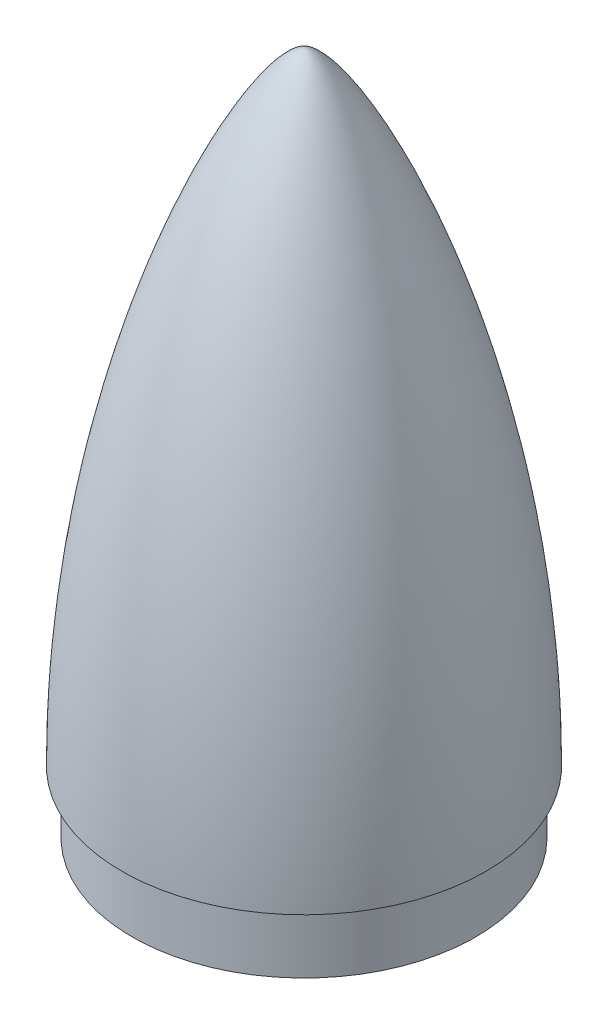
ISO-10303-21;
HEADER;
FILE_DESCRIPTION(('STEP AP214'),'2;1');
FILE_NAME('part.step','',(''),(''),'','','');
FILE_SCHEMA(('AUTOMOTIVE_DESIGN { 1 0 10303 214 1 1 1 1 }'));
ENDSEC;
DATA;
#1=APPLICATION_CONTEXT('core data for automotive mechanical design processes');
#2=APPLICATION_PROTOCOL_DEFINITION('international standard','automotive_design',2000,#1);
#3=PRODUCT_CONTEXT('',#1,'mechanical');
#4=PRODUCT('Part','Part','',(#3));
#5=PRODUCT_RELATED_PRODUCT_CATEGORY('part','',(#4));
#6=PRODUCT_DEFINITION_FORMATION('','',#4);
#7=PRODUCT_DEFINITION_CONTEXT('part definition',#1,'design');
#8=PRODUCT_DEFINITION('design','',#6,#7);
#9=PRODUCT_DEFINITION_SHAPE('','',#8);
#10=(LENGTH_UNIT() NAMED_UNIT(*) SI_UNIT(.MILLI.,.METRE.));
#11=(NAMED_UNIT(*) PLANE_ANGLE_UNIT() SI_UNIT($,.RADIAN.));
#12=(NAMED_UNIT(*) SI_UNIT($,.STERADIAN.) SOLID_ANGLE_UNIT());
#13=UNCERTAINTY_MEASURE_WITH_UNIT(LENGTH_MEASURE(1.E-05),#10,'distance_accuracy_value','');
#14=(GEOMETRIC_REPRESENTATION_CONTEXT(3) GLOBAL_UNCERTAINTY_ASSIGNED_CONTEXT((#13)) GLOBAL_UNIT_ASSIGNED_CONTEXT((#10,
#11,#12)) REPRESENTATION_CONTEXT('',''));
#15=CARTESIAN_POINT('',(0.,0.,0.));
#16=DIRECTION('',(0.,0.,1.));
#17=DIRECTION('',(1.,0.,0.));
#18=AXIS2_PLACEMENT_3D('',#15,#16,#17);
#19=CARTESIAN_POINT('',(44.,0.,0.));
#20=CARTESIAN_POINT('',(44.0000000000001,84.407059952808,0.));
#21=CARTESIAN_POINT('',(9.01497984593192,150.,0.));
#22=CARTESIAN_POINT('',(0.,150.,0.));
#23=B_SPLINE_CURVE_WITH_KNOTS('',3,(#19,#20,#21,#22),.UNSPECIFIED.,.F.,.F.,(4,4),(0.,1.),.UNSPECIFIED.);
#24=CARTESIAN_POINT('',(0.,0.,0.));
#25=DIRECTION('',(0.,-1.,0.));
#26=AXIS1_PLACEMENT('',#24,#25);
#27=SURFACE_OF_REVOLUTION('',#23,#26);
#28=CARTESIAN_POINT('',(0.,150.,0.));
#29=VERTEX_POINT('',#28);
#30=VERTEX_LOOP('',#29);
#31=FACE_BOUND('',#30,.T.);
#32=CARTESIAN_POINT('',(0.,0.,0.));
#33=DIRECTION('',(0.,-1.,0.));
#34=DIRECTION('',(0.,0.,-1.));
#35=AXIS2_PLACEMENT_3D('',#32,#33,#34);
#36=CIRCLE('',#35,44.);
#37=CARTESIAN_POINT('',(0.,0.,-44.));
#38=VERTEX_POINT('',#37);
#39=EDGE_CURVE('E67',#38,#38,#36,.T.);
#40=ORIENTED_EDGE('',*,*,#39,.F.);
#41=EDGE_LOOP('',(#40));
#42=FACE_BOUND('',#41,.T.);
#43=ADVANCED_FACE('F47',(#31,#42),#27,.F.);
#44=CARTESIAN_POINT('',(0.,148.75,0.));
#45=CARTESIAN_POINT('',(0.0623905602751855,148.75,0.));
#46=CARTESIAN_POINT('',(0.161743714489658,148.739451328776,0.));
#47=CARTESIAN_POINT('',(0.553973413238509,148.630839322375,0.));
#48=CARTESIAN_POINT('',(1.23751493912135,148.274478013651,0.));
#49=CARTESIAN_POINT('',(2.2942810923493,147.453869911865,0.));
#50=CARTESIAN_POINT('',(3.51515873655765,146.254254098257,0.));
#51=CARTESIAN_POINT('',(4.86950546820111,144.690429147135,0.));
#52=CARTESIAN_POINT('',(6.82294126583445,142.138302248313,0.));
#53=CARTESIAN_POINT('',(9.49935283518177,138.103007178591,0.));
#54=CARTESIAN_POINT('',(12.9776158566095,131.992355553985,0.));
#55=CARTESIAN_POINT('',(17.8440104471557,122.253564222882,0.));
#56=CARTESIAN_POINT('',(24.1264268727051,107.276162170958,0.));
#57=CARTESIAN_POINT('',(30.079442309622,89.023647999674,0.));
#58=CARTESIAN_POINT('',(34.2912655478599,72.7300156800433,0.));
#59=CARTESIAN_POINT('',(37.0868645730298,59.732316721589,0.));
#60=CARTESIAN_POINT('',(39.4313372413065,46.0242759583606,0.));
#61=CARTESIAN_POINT('',(41.2369275866553,31.6771319500356,0.));
#62=CARTESIAN_POINT('',(42.2195219417275,19.2347666509852,0.));
#63=CARTESIAN_POINT('',(42.6356286511845,9.351465349237,0.));
#64=CARTESIAN_POINT('',(42.728000161831,4.35345296772243,0.));
#65=CARTESIAN_POINT('',(42.7450910899918,1.75035268820928,0.));
#66=CARTESIAN_POINT('',(42.7466689224684,1.43630274708062,0.));
#67=CARTESIAN_POINT('',(42.7474336565968,1.24999999999998,0.));
#68=B_SPLINE_CURVE_WITH_KNOTS('',3,(#44,#45,#46,#47,#48,#49,#50,#51,#52,#53,#54,#55,#56,#57,#58,
#59,#60,#61,#62,#63,#64,#65,#66,#67),.UNSPECIFIED.,.F.,.F.,(4,1,1,1,1,1,1,1,1,1,1,1,1,1,1,1,1,1,
1,1,1,4),(0.,0.0155474660993988,0.0310949321987976,0.0621898643975952,0.0932847965963928,
0.12437972879519,0.155474660993988,0.186569593192786,0.248759457590381,0.310949321987976,
0.373139186385571,0.497518915180762,0.621898643975952,0.684088508373547,0.746278372771142,
0.808468237168738,0.870658101566333,0.932847965963928,0.963942898162725,0.991309547131214,
0.992800860423338,0.995037830361523),.UNSPECIFIED.);
#69=CARTESIAN_POINT('',(0.,0.,0.));
#70=DIRECTION('',(0.,-1.,0.));
#71=AXIS1_PLACEMENT('',#69,#70);
#72=SURFACE_OF_REVOLUTION('',#68,#71);
#73=CARTESIAN_POINT('',(0.,1.99999999995286,0.));
#74=DIRECTION('',(0.,-1.,0.));
#75=DIRECTION('',(0.,0.,-1.));
#76=AXIS2_PLACEMENT_3D('',#73,#74,#75);
#77=CIRCLE('',#76,42.7434327526829);
#78=CARTESIAN_POINT('',(0.,1.99999999995286,-42.7434327526829));
#79=VERTEX_POINT('',#78);
#80=EDGE_CURVE('E11',#79,#79,#77,.T.);
#81=ORIENTED_EDGE('',*,*,#80,.T.);
#82=EDGE_LOOP('',(#81));
#83=FACE_BOUND('',#82,.T.);
#84=CARTESIAN_POINT('',(0.,148.75,0.));
#85=VERTEX_POINT('',#84);
#86=VERTEX_LOOP('',#85);
#87=FACE_BOUND('',#86,.T.);
#88=ADVANCED_FACE('F64',(#83,#87),#72,.F.);
#89=CARTESIAN_POINT('',(38.,1.99999999997643,0.));
#90=DIRECTION('',(0.,1.,0.));
#91=DIRECTION('',(0.,0.,1.));
#92=AXIS2_PLACEMENT_3D('',#89,#90,#91);
#93=PLANE('',#92);
#94=CARTESIAN_POINT('',(0.,2.,0.));
#95=DIRECTION('',(0.,-1.,0.));
#96=DIRECTION('',(0.,0.,-1.));
#97=AXIS2_PLACEMENT_3D('',#94,#95,#96);
#98=CIRCLE('',#97,38.);
#99=CARTESIAN_POINT('',(0.,2.,-38.));
#100=VERTEX_POINT('',#99);
#101=EDGE_CURVE('E56',#100,#100,#98,.T.);
#102=ORIENTED_EDGE('',*,*,#101,.T.);
#103=EDGE_LOOP('',(#102));
#104=FACE_BOUND('',#103,.T.);
#105=ORIENTED_EDGE('',*,*,#80,.F.);
#106=EDGE_LOOP('',(#105));
#107=FACE_BOUND('',#106,.T.);
#108=ADVANCED_FACE('F91',(#104,#107),#93,.T.);
#109=CARTESIAN_POINT('',(0.,0.,0.));
#110=DIRECTION('',(0.,-1.,0.));
#111=DIRECTION('',(0.,0.,-1.));
#112=AXIS2_PLACEMENT_3D('',#109,#110,#111);
#113=CYLINDRICAL_SURFACE('',#112,38.);
#114=CARTESIAN_POINT('',(0.,-15.,0.));
#115=DIRECTION('',(0.,-1.,0.));
#116=DIRECTION('',(0.,0.,-1.));
#117=AXIS2_PLACEMENT_3D('',#114,#115,#116);
#118=CIRCLE('',#117,38.);
#119=CARTESIAN_POINT('',(0.,-15.,-38.));
#120=VERTEX_POINT('',#119);
#121=EDGE_CURVE('E84',#120,#120,#118,.T.);
#122=ORIENTED_EDGE('',*,*,#121,.T.);
#123=EDGE_LOOP('',(#122));
#124=FACE_BOUND('',#123,.T.);
#125=ORIENTED_EDGE('',*,*,#101,.F.);
#126=EDGE_LOOP('',(#125));
#127=FACE_BOUND('',#126,.T.);
#128=ADVANCED_FACE('F94',(#124,#127),#113,.F.);
#129=CARTESIAN_POINT('',(41.5,-15.,0.));
#130=DIRECTION('',(0.,-1.,0.));
#131=DIRECTION('',(0.,0.,-1.));
#132=AXIS2_PLACEMENT_3D('',#129,#130,#131);
#133=PLANE('',#132);
#134=CARTESIAN_POINT('',(0.,-15.,0.));
#135=DIRECTION('',(0.,-1.,0.));
#136=DIRECTION('',(0.,0.,-1.));
#137=AXIS2_PLACEMENT_3D('',#134,#135,#136);
#138=CIRCLE('',#137,41.5);
#139=CARTESIAN_POINT('',(0.,-15.,-41.5));
#140=VERTEX_POINT('',#139);
#141=EDGE_CURVE('E74',#140,#140,#138,.T.);
#142=ORIENTED_EDGE('',*,*,#141,.T.);
#143=EDGE_LOOP('',(#142));
#144=FACE_BOUND('',#143,.T.);
#145=ORIENTED_EDGE('',*,*,#121,.F.);
#146=EDGE_LOOP('',(#145));
#147=FACE_BOUND('',#146,.T.);
#148=ADVANCED_FACE('F96',(#144,#147),#133,.T.);
#149=CARTESIAN_POINT('',(0.,0.,0.));
#150=DIRECTION('',(0.,-1.,0.));
#151=DIRECTION('',(0.,0.,-1.));
#152=AXIS2_PLACEMENT_3D('',#149,#150,#151);
#153=CYLINDRICAL_SURFACE('',#152,41.5);
#154=CARTESIAN_POINT('',(0.,0.,0.));
#155=DIRECTION('',(0.,-1.,0.));
#156=DIRECTION('',(0.,0.,-1.));
#157=AXIS2_PLACEMENT_3D('',#154,#155,#156);
#158=CIRCLE('',#157,41.5);
#159=CARTESIAN_POINT('',(0.,0.,-41.5));
#160=VERTEX_POINT('',#159);
#161=EDGE_CURVE('E70',#160,#160,#158,.T.);
#162=ORIENTED_EDGE('',*,*,#161,.T.);
#163=EDGE_LOOP('',(#162));
#164=FACE_BOUND('',#163,.T.);
#165=ORIENTED_EDGE('',*,*,#141,.F.);
#166=EDGE_LOOP('',(#165));
#167=FACE_BOUND('',#166,.T.);
#168=ADVANCED_FACE('F103',(#164,#167),#153,.T.);
#169=CARTESIAN_POINT('',(41.5,0.,0.));
#170=DIRECTION('',(0.,-1.,0.));
#171=DIRECTION('',(0.,0.,-1.));
#172=AXIS2_PLACEMENT_3D('',#169,#170,#171);
#173=PLANE('',#172);
#174=ORIENTED_EDGE('',*,*,#39,.T.);
#175=EDGE_LOOP('',(#174));
#176=FACE_BOUND('',#175,.T.);
#177=ORIENTED_EDGE('',*,*,#161,.F.);
#178=EDGE_LOOP('',(#177));
#179=FACE_BOUND('',#178,.T.);
#180=ADVANCED_FACE('F140',(#176,#179),#173,.T.);
#181=CLOSED_SHELL('',(#43,#88,#108,#128,#148,#168,#180));
#182=MANIFOLD_SOLID_BREP('B2',#181);
#183=ADVANCED_BREP_SHAPE_REPRESENTATION('',(#18,#182),#14);
#184=SHAPE_DEFINITION_REPRESENTATION(#9,#183);
ENDSEC;
END-ISO-10303-21;
